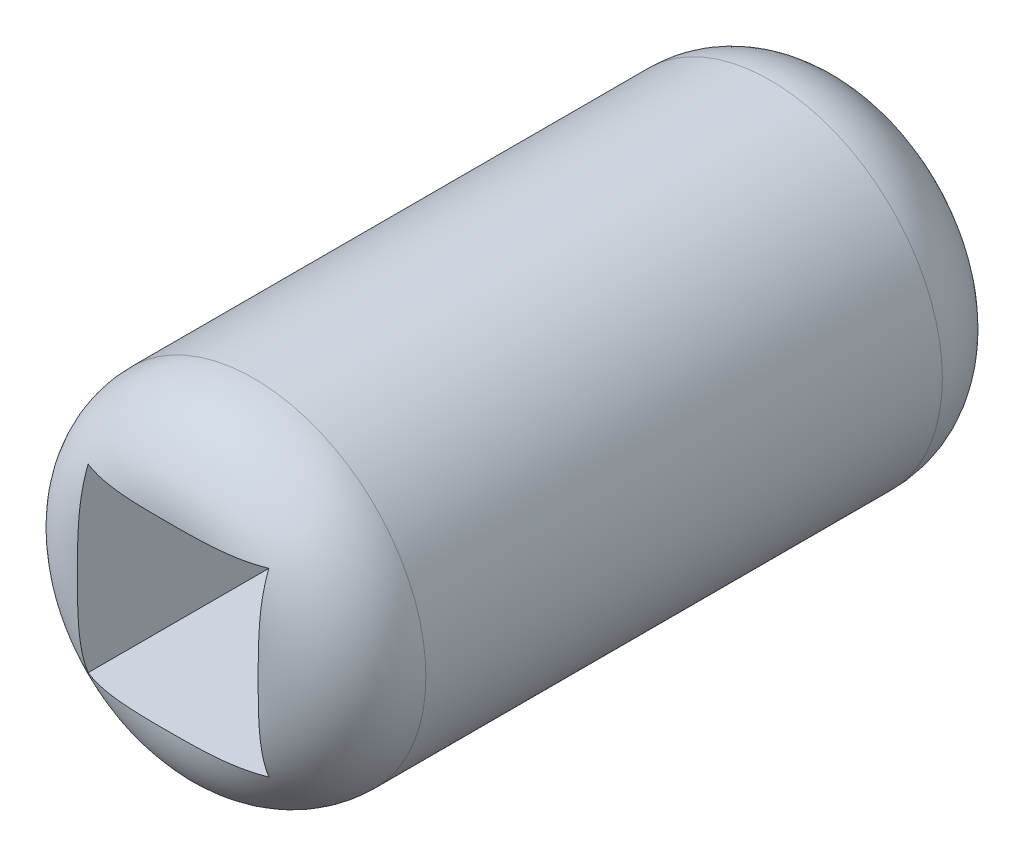
ISO-10303-21;
HEADER;
FILE_DESCRIPTION(('STEP AP214'),'2;1');
FILE_NAME('part.step','',(''),(''),'','','');
FILE_SCHEMA(('AUTOMOTIVE_DESIGN { 1 0 10303 214 1 1 1 1 }'));
ENDSEC;
DATA;
#1=APPLICATION_CONTEXT('core data for automotive mechanical design processes');
#2=APPLICATION_PROTOCOL_DEFINITION('international standard','automotive_design',2000,#1);
#3=PRODUCT_CONTEXT('',#1,'mechanical');
#4=PRODUCT('Part','Part','',(#3));
#5=PRODUCT_RELATED_PRODUCT_CATEGORY('part','',(#4));
#6=PRODUCT_DEFINITION_FORMATION('','',#4);
#7=PRODUCT_DEFINITION_CONTEXT('part definition',#1,'design');
#8=PRODUCT_DEFINITION('design','',#6,#7);
#9=PRODUCT_DEFINITION_SHAPE('','',#8);
#10=(LENGTH_UNIT() NAMED_UNIT(*) SI_UNIT(.MILLI.,.METRE.));
#11=(NAMED_UNIT(*) PLANE_ANGLE_UNIT() SI_UNIT($,.RADIAN.));
#12=(NAMED_UNIT(*) SI_UNIT($,.STERADIAN.) SOLID_ANGLE_UNIT());
#13=UNCERTAINTY_MEASURE_WITH_UNIT(LENGTH_MEASURE(1.E-05),#10,'distance_accuracy_value','');
#14=(GEOMETRIC_REPRESENTATION_CONTEXT(3) GLOBAL_UNCERTAINTY_ASSIGNED_CONTEXT((#13)) GLOBAL_UNIT_ASSIGNED_CONTEXT((#10,
#11,#12)) REPRESENTATION_CONTEXT('',''));
#15=CARTESIAN_POINT('',(0.,0.,0.));
#16=DIRECTION('',(0.,0.,1.));
#17=DIRECTION('',(1.,0.,0.));
#18=AXIS2_PLACEMENT_3D('',#15,#16,#17);
#19=CARTESIAN_POINT('',(0.,0.,0.));
#20=DIRECTION('',(0.,0.,-1.));
#21=DIRECTION('',(-1.,0.,0.));
#22=AXIS2_PLACEMENT_3D('',#19,#20,#21);
#23=CYLINDRICAL_SURFACE('',#22,2.55);
#24=CARTESIAN_POINT('',(0.,0.,-50.));
#25=DIRECTION('',(0.,0.,-1.));
#26=DIRECTION('',(-1.,0.,0.));
#27=AXIS2_PLACEMENT_3D('',#24,#25,#26);
#28=CIRCLE('',#27,2.55);
#29=CARTESIAN_POINT('',(-2.55,0.,-50.));
#30=VERTEX_POINT('',#29);
#31=EDGE_CURVE('E109',#30,#30,#28,.T.);
#32=ORIENTED_EDGE('',*,*,#31,.F.);
#33=EDGE_LOOP('',(#32));
#34=FACE_BOUND('',#33,.T.);
#35=CARTESIAN_POINT('',(0.,0.,-52.));
#36=DIRECTION('',(0.,0.,-1.));
#37=DIRECTION('',(-1.,0.,0.));
#38=AXIS2_PLACEMENT_3D('',#35,#36,#37);
#39=CIRCLE('',#38,2.55);
#40=CARTESIAN_POINT('',(-2.55,0.,-52.));
#41=VERTEX_POINT('',#40);
#42=EDGE_CURVE('E113',#41,#41,#39,.F.);
#43=ORIENTED_EDGE('',*,*,#42,.F.);
#44=EDGE_LOOP('',(#43));
#45=FACE_BOUND('',#44,.T.);
#46=ADVANCED_FACE('F38',(#34,#45),#23,.F.);
#47=CARTESIAN_POINT('',(0.,0.,-55.));
#48=DIRECTION('',(0.,0.,1.));
#49=DIRECTION('',(1.,0.,0.));
#50=AXIS2_PLACEMENT_3D('',#47,#48,#49);
#51=CYLINDRICAL_SURFACE('',#50,20.);
#52=CARTESIAN_POINT('',(0.,0.,15.));
#53=DIRECTION('',(0.,0.,1.));
#54=DIRECTION('',(1.,0.,0.));
#55=AXIS2_PLACEMENT_3D('',#52,#53,#54);
#56=CIRCLE('',#55,20.);
#57=CARTESIAN_POINT('',(20.,0.,15.));
#58=VERTEX_POINT('',#57);
#59=EDGE_CURVE('E47',#58,#58,#56,.F.);
#60=ORIENTED_EDGE('',*,*,#59,.T.);
#61=EDGE_LOOP('',(#60));
#62=FACE_BOUND('',#61,.T.);
#63=CARTESIAN_POINT('',(0.,0.,-45.));
#64=DIRECTION('',(0.,0.,1.));
#65=DIRECTION('',(1.,0.,0.));
#66=AXIS2_PLACEMENT_3D('',#63,#64,#65);
#67=CIRCLE('',#66,20.);
#68=CARTESIAN_POINT('',(20.,0.,-45.));
#69=VERTEX_POINT('',#68);
#70=EDGE_CURVE('E218',#69,#69,#67,.T.);
#71=ORIENTED_EDGE('',*,*,#70,.T.);
#72=EDGE_LOOP('',(#71));
#73=FACE_BOUND('',#72,.T.);
#74=ADVANCED_FACE('F156',(#62,#73),#51,.T.);
#75=CARTESIAN_POINT('',(0.,0.,-55.));
#76=DIRECTION('',(0.,0.,1.));
#77=DIRECTION('',(1.,0.,0.));
#78=AXIS2_PLACEMENT_3D('',#75,#76,#77);
#79=PLANE('',#78);
#80=CARTESIAN_POINT('',(0.,0.,-55.));
#81=DIRECTION('',(0.,0.,1.));
#82=DIRECTION('',(1.,0.,0.));
#83=AXIS2_PLACEMENT_3D('',#80,#81,#82);
#84=CIRCLE('',#83,10.);
#85=CARTESIAN_POINT('',(10.,0.,-55.));
#86=VERTEX_POINT('',#85);
#87=EDGE_CURVE('E11',#86,#86,#84,.F.);
#88=ORIENTED_EDGE('',*,*,#87,.T.);
#89=EDGE_LOOP('',(#88));
#90=FACE_BOUND('',#89,.T.);
#91=CARTESIAN_POINT('',(0.,0.,-55.));
#92=DIRECTION('',(0.,0.,-1.));
#93=DIRECTION('',(-1.,0.,0.));
#94=AXIS2_PLACEMENT_3D('',#91,#92,#93);
#95=CIRCLE('',#94,7.);
#96=CARTESIAN_POINT('',(-7.,0.,-55.));
#97=VERTEX_POINT('',#96);
#98=EDGE_CURVE('E116',#97,#97,#95,.T.);
#99=ORIENTED_EDGE('',*,*,#98,.F.);
#100=EDGE_LOOP('',(#99));
#101=FACE_BOUND('',#100,.T.);
#102=ADVANCED_FACE('F191',(#90,#101),#79,.F.);
#103=CARTESIAN_POINT('',(10.5,-10.5,50.));
#104=DIRECTION('',(-1.,0.,0.));
#105=DIRECTION('',(0.,0.,1.));
#106=AXIS2_PLACEMENT_3D('',#103,#104,#105);
#107=PLANE('',#106);
#108=CARTESIAN_POINT('',(10.5,-10.5,23.745561622809));
#109=CARTESIAN_POINT('',(10.5,-10.2820953312332,23.8310084995856));
#110=CARTESIAN_POINT('',(10.5,-10.0619659791213,23.9106518314645));
#111=CARTESIAN_POINT('',(10.5,-9.61814076353916,24.0589348982989));
#112=CARTESIAN_POINT('',(10.5,-9.39444664378138,24.1275798418574));
#113=CARTESIAN_POINT('',(10.5,-8.94491580691213,24.2543382269845));
#114=CARTESIAN_POINT('',(10.5,-8.71908870231958,24.3124859693475));
#115=CARTESIAN_POINT('',(10.5,-8.26518905010618,24.4192841094692));
#116=CARTESIAN_POINT('',(10.5,-8.03711623406637,24.4679333570821));
#117=CARTESIAN_POINT('',(10.5,-7.3541870184505,24.6000960661407));
#118=CARTESIAN_POINT('',(10.5,-6.89684302134824,24.6708563458332));
#119=CARTESIAN_POINT('',(10.5,-5.97856273663137,24.7851692434514));
#120=CARTESIAN_POINT('',(10.5,-5.51762359824146,24.8286974339367));
#121=CARTESIAN_POINT('',(10.5,-4.63711294746988,24.8927615944288));
#122=CARTESIAN_POINT('',(10.5,-4.21766083545257,24.9150525852469));
#123=CARTESIAN_POINT('',(10.5,-3.37846111646088,24.9485716373263));
#124=CARTESIAN_POINT('',(10.5,-2.95871360957952,24.959802463004));
#125=CARTESIAN_POINT('',(10.5,-2.32735362697719,24.9717400651592));
#126=CARTESIAN_POINT('',(10.5,-2.11577827115353,24.9749037850208));
#127=CARTESIAN_POINT('',(10.5,-1.69261161496323,24.9799852820541));
#128=CARTESIAN_POINT('',(10.5,-1.48102031456945,24.9819030570554));
#129=CARTESIAN_POINT('',(10.5,-1.05785688988513,24.9848388513147));
#130=CARTESIAN_POINT('',(10.5,-0.846284766230479,24.9858569753128));
#131=CARTESIAN_POINT('',(10.5,-0.423141632686202,24.9871714675552));
#132=CARTESIAN_POINT('',(10.5,-0.211570622834858,24.9874678475918));
#133=CARTESIAN_POINT('',(10.5,0.,24.9874921777191));
#134=B_SPLINE_CURVE_WITH_KNOTS('',3,(#108,#109,#110,#111,#112,#113,#114,#115,#116,#117,#118,
#119,#120,#121,#122,#123,#124,#125,#126,#127,#128,#129,#130,#131,#132,#133),.UNSPECIFIED.,.F.,
.F.,(4,2,2,2,2,2,2,2,2,2,2,2,4),(0.,0.702025204485356,1.40371695574493,2.10307262443637,
2.80251292368591,4.18968103787796,5.57809167754459,6.83801126825105,8.09761587026198,
8.73241127418308,9.36720778390113,10.0019303789456,10.6366426033795),.UNSPECIFIED.);
#135=CARTESIAN_POINT('',(10.5,-10.5,23.745561622809));
#136=VERTEX_POINT('',#135);
#137=CARTESIAN_POINT('',(10.5,0.,24.9874921777191));
#138=VERTEX_POINT('',#137);
#139=EDGE_CURVE('E93',#136,#138,#134,.T.);
#140=ORIENTED_EDGE('',*,*,#139,.T.);
#141=CARTESIAN_POINT('',(10.5,0.,24.9874921777191));
#142=CARTESIAN_POINT('',(10.5,0.221423204439968,24.9874630424113));
#143=CARTESIAN_POINT('',(10.5,0.442846906870143,24.987140852023));
#144=CARTESIAN_POINT('',(10.5,0.885696222999842,24.985697516879));
#145=CARTESIAN_POINT('',(10.5,1.10712183664208,24.9845763553695));
#146=CARTESIAN_POINT('',(10.5,1.55003468137708,24.9813217168943));
#147=CARTESIAN_POINT('',(10.5,1.77152191048333,24.9791879287923));
#148=CARTESIAN_POINT('',(10.5,2.21447669861017,24.9734943961953));
#149=CARTESIAN_POINT('',(10.5,2.43594425768813,24.9699346560062));
#150=CARTESIAN_POINT('',(10.5,3.09650405305266,24.9564309073825));
#151=CARTESIAN_POINT('',(10.5,3.5355497766985,24.9436508162303));
#152=CARTESIAN_POINT('',(10.5,4.41320079831898,24.905223892119));
#153=CARTESIAN_POINT('',(10.5,4.85180602272994,24.8795751830866));
#154=CARTESIAN_POINT('',(10.5,5.7316836655817,24.8089126507154));
#155=CARTESIAN_POINT('',(10.5,6.17294241813557,24.7637191213698));
#156=CARTESIAN_POINT('',(10.5,7.05187001518709,24.6474670360696));
#157=CARTESIAN_POINT('',(10.5,7.48954143888598,24.5764291082983));
#158=CARTESIAN_POINT('',(10.5,8.14303306654956,24.4455779948419));
#159=CARTESIAN_POINT('',(10.5,8.36125652381611,24.3976628579725));
#160=CARTESIAN_POINT('',(10.5,8.79557255981704,24.2930226424308));
#161=CARTESIAN_POINT('',(10.5,9.01166536354846,24.2362985048187));
#162=CARTESIAN_POINT('',(10.5,9.44179970212028,24.1132033021743));
#163=CARTESIAN_POINT('',(10.5,9.65583317239433,24.0468039016714));
#164=CARTESIAN_POINT('',(10.5,10.0805930708052,23.9038997232101));
#165=CARTESIAN_POINT('',(10.5,10.2913180766552,23.827390725465));
#166=CARTESIAN_POINT('',(10.5,10.5,23.7455616228092));
#167=B_SPLINE_CURVE_WITH_KNOTS('',3,(#141,#142,#143,#144,#145,#146,#147,#148,#149,#150,#151,
#152,#153,#154,#155,#156,#157,#158,#159,#160,#161,#162,#163,#164,#165,#166),.UNSPECIFIED.,.F.,
.F.,(4,2,2,2,2,2,2,2,2,2,2,2,4),(0.,0.664270109941244,1.32855414944726,1.99304242686941,
2.65752869771302,3.97511313219947,5.29288970881806,6.62304921567723,7.95214935211501,
8.62226143678734,9.29230198296447,9.96434582633915,10.6366710749151),.UNSPECIFIED.);
#168=CARTESIAN_POINT('',(10.5,10.5,23.745561622809));
#169=VERTEX_POINT('',#168);
#170=EDGE_CURVE('E91',#138,#169,#167,.T.);
#171=ORIENTED_EDGE('',*,*,#170,.T.);
#172=DIRECTION('',(0.,0.,-1.));
#173=VECTOR('',#172,1.);
#174=CARTESIAN_POINT('',(10.5,10.5,50.));
#175=LINE('',#174,#173);
#176=CARTESIAN_POINT('',(10.5,10.5,-50.));
#177=VERTEX_POINT('',#176);
#178=EDGE_CURVE('E83',#169,#177,#175,.T.);
#179=ORIENTED_EDGE('',*,*,#178,.T.);
#180=DIRECTION('',(0.,1.,0.));
#181=VECTOR('',#180,1.);
#182=CARTESIAN_POINT('',(10.5,-10.5,-50.));
#183=LINE('',#182,#181);
#184=CARTESIAN_POINT('',(10.5,-10.5,-50.));
#185=VERTEX_POINT('',#184);
#186=EDGE_CURVE('E88',#185,#177,#183,.T.);
#187=ORIENTED_EDGE('',*,*,#186,.F.);
#188=DIRECTION('',(0.,0.,-1.));
#189=VECTOR('',#188,1.);
#190=CARTESIAN_POINT('',(10.5,-10.5,50.));
#191=LINE('',#190,#189);
#192=EDGE_CURVE('E123',#136,#185,#191,.T.);
#193=ORIENTED_EDGE('',*,*,#192,.F.);
#194=EDGE_LOOP('',(#140,#171,#179,#187,#193));
#195=FACE_BOUND('',#194,.T.);
#196=ADVANCED_FACE('F85',(#195),#107,.T.);
#197=CARTESIAN_POINT('',(-10.5,10.5,50.));
#198=DIRECTION('',(0.,-1.,0.));
#199=DIRECTION('',(0.,0.,-1.));
#200=AXIS2_PLACEMENT_3D('',#197,#198,#199);
#201=PLANE('',#200);
#202=ORIENTED_EDGE('',*,*,#178,.F.);
#203=CARTESIAN_POINT('',(10.5,10.5,23.745561622809));
#204=CARTESIAN_POINT('',(10.2835748942635,10.5,23.8304280457561));
#205=CARTESIAN_POINT('',(10.0649550581823,10.5,23.9095698882964));
#206=CARTESIAN_POINT('',(9.62419066302592,10.5,24.0569950410334));
#207=CARTESIAN_POINT('',(9.40204779648804,10.5,24.1252834014723));
#208=CARTESIAN_POINT('',(8.9556982112672,10.5,24.2514442653665));
#209=CARTESIAN_POINT('',(8.73150171455172,10.5,24.3093531451678));
#210=CARTESIAN_POINT('',(8.28088521552548,10.5,24.4157903737855));
#211=CARTESIAN_POINT('',(8.054464951704,10.5,24.464317605116));
#212=CARTESIAN_POINT('',(7.37010774049275,10.5,24.5975029892255));
#213=CARTESIAN_POINT('',(6.90958809617885,10.5,24.6690746225939));
#214=CARTESIAN_POINT('',(6.2162360233444,10.5,24.7556771331127));
#215=CARTESIAN_POINT('',(5.98457713201519,10.5,24.7810927499888));
#216=CARTESIAN_POINT('',(5.52067506017507,10.5,24.8259388818956));
#217=CARTESIAN_POINT('',(5.28843188859176,10.5,24.8453694878221));
#218=CARTESIAN_POINT('',(4.56098138803612,10.5,24.8983081574619));
#219=CARTESIAN_POINT('',(4.0651352511916,10.5,24.9229174348038));
#220=CARTESIAN_POINT('',(3.32102194212009,10.5,24.949166879232));
#221=CARTESIAN_POINT('',(3.07289312823323,10.5,24.9561395043126));
#222=CARTESIAN_POINT('',(2.57657406784095,10.5,24.9674454744056));
#223=CARTESIAN_POINT('',(2.32838382219619,10.5,24.9717788545078));
#224=CARTESIAN_POINT('',(1.83169306214223,10.5,24.9785917604535));
#225=CARTESIAN_POINT('',(1.58319252245418,10.5,24.9810691253163));
#226=CARTESIAN_POINT('',(1.08618182262432,10.5,24.9847390053464));
#227=CARTESIAN_POINT('',(0.837671662468739,10.5,24.9859315186025));
#228=CARTESIAN_POINT('',(0.340683255518348,10.5,24.9873716811018));
#229=CARTESIAN_POINT('',(0.0922050090451002,10.5,24.9876194605327));
#230=CARTESIAN_POINT('',(-0.404750693599833,10.5,24.9872483285497));
#231=CARTESIAN_POINT('',(-0.653228149772027,10.5,24.9866294179133));
#232=CARTESIAN_POINT('',(-1.14927839481827,10.5,24.9843396618238));
#233=CARTESIAN_POINT('',(-1.39685119942949,10.5,24.9826726360382));
#234=CARTESIAN_POINT('',(-1.89198382090432,10.5,24.9778516308698));
#235=CARTESIAN_POINT('',(-2.13954363772699,10.5,24.9746976470511));
#236=CARTESIAN_POINT('',(-2.63468507915313,10.5,24.9662435167823));
#237=CARTESIAN_POINT('',(-2.88226669639269,10.5,24.9609428939295));
#238=CARTESIAN_POINT('',(-3.37734663742692,10.5,24.9473506668242));
#239=CARTESIAN_POINT('',(-3.62484496124234,10.5,24.9390590633171));
#240=CARTESIAN_POINT('',(-4.36607147427464,10.5,24.9082969279563));
#241=CARTESIAN_POINT('',(-4.85958957810443,10.5,24.8799289500097));
#242=CARTESIAN_POINT('',(-5.84453512995613,10.5,24.798740799315));
#243=CARTESIAN_POINT('',(-6.33596356029214,10.5,24.7459337961361));
#244=CARTESIAN_POINT('',(-7.1383601137208,10.5,24.6319064595174));
#245=CARTESIAN_POINT('',(-7.45071465317807,10.5,24.5805292642351));
#246=CARTESIAN_POINT('',(-8.07245797179513,10.5,24.4618569685851));
#247=CARTESIAN_POINT('',(-8.38184645590487,10.5,24.3945603013693));
#248=CARTESIAN_POINT('',(-8.99635643437308,10.5,24.2419774181668));
#249=CARTESIAN_POINT('',(-9.3014760678764,10.5,24.1566836024253));
#250=CARTESIAN_POINT('',(-9.90574207915073,10.5,23.9663559343863));
#251=CARTESIAN_POINT('',(-10.2048834189848,10.5,23.8613061504062));
#252=CARTESIAN_POINT('',(-10.5,10.5,23.745561622809));
#253=B_SPLINE_CURVE_WITH_KNOTS('',3,(#203,#204,#205,#206,#207,#208,#209,#210,#211,#212,#213,
#214,#215,#216,#217,#218,#219,#220,#221,#222,#223,#224,#225,#226,#227,#228,#229,#230,#231,#232,
#233,#234,#235,#236,#237,#238,#239,#240,#241,#242,#243,#244,#245,#246,#247,#248,#249,#250,#251,
#252),.UNSPECIFIED.,.F.,.F.,(4,2,2,2,2,2,2,2,2,2,2,2,2,2,2,2,2,2,2,2,2,2,2,2,4),(0.,
0.697260024351112,1.39419465019898,2.08863686248113,2.78316174167626,4.18001009890612,
4.87911145196581,5.57820218708144,7.06715702423859,7.81183657102314,8.55650621678973,
9.30204154863823,10.0475779895514,10.7930116892392,11.5384447201625,12.2811767765433,
13.0239110486867,13.7668102459362,14.5097092580165,15.9923331411893,17.474159004674,
18.4234679994783,19.3728704673875,20.3226746499162,21.2732480873042),.UNSPECIFIED.);
#254=CARTESIAN_POINT('',(-10.5,10.5,23.745561622809));
#255=VERTEX_POINT('',#254);
#256=EDGE_CURVE('E62',#169,#255,#253,.T.);
#257=ORIENTED_EDGE('',*,*,#256,.T.);
#258=DIRECTION('',(0.,0.,-1.));
#259=VECTOR('',#258,1.);
#260=CARTESIAN_POINT('',(-10.5,10.5,50.));
#261=LINE('',#260,#259);
#262=CARTESIAN_POINT('',(-10.5,10.5,-50.));
#263=VERTEX_POINT('',#262);
#264=EDGE_CURVE('E94',#255,#263,#261,.T.);
#265=ORIENTED_EDGE('',*,*,#264,.T.);
#266=DIRECTION('',(-1.,0.,0.));
#267=VECTOR('',#266,1.);
#268=CARTESIAN_POINT('',(-10.5,10.5,-50.));
#269=LINE('',#268,#267);
#270=EDGE_CURVE('E97',#177,#263,#269,.T.);
#271=ORIENTED_EDGE('',*,*,#270,.F.);
#272=EDGE_LOOP('',(#202,#257,#265,#271));
#273=FACE_BOUND('',#272,.T.);
#274=ADVANCED_FACE('F98',(#273),#201,.T.);
#275=CARTESIAN_POINT('',(-10.5,-10.5,50.));
#276=DIRECTION('',(1.,0.,0.));
#277=DIRECTION('',(0.,0.,-1.));
#278=AXIS2_PLACEMENT_3D('',#275,#276,#277);
#279=PLANE('',#278);
#280=ORIENTED_EDGE('',*,*,#264,.F.);
#281=CARTESIAN_POINT('',(-10.5,10.5,23.745561622809));
#282=CARTESIAN_POINT('',(-10.5,10.2835748942634,23.8304280457561));
#283=CARTESIAN_POINT('',(-10.5,10.0649550581823,23.9095698882964));
#284=CARTESIAN_POINT('',(-10.5,9.62419066302591,24.0569950410334));
#285=CARTESIAN_POINT('',(-10.5,9.40204779648803,24.1252834014723));
#286=CARTESIAN_POINT('',(-10.5,8.95569821126719,24.2514442653665));
#287=CARTESIAN_POINT('',(-10.5,8.73150171455172,24.3093531451678));
#288=CARTESIAN_POINT('',(-10.5,8.28088521552547,24.4157903737856));
#289=CARTESIAN_POINT('',(-10.5,8.05446495170399,24.464317605116));
#290=CARTESIAN_POINT('',(-10.5,7.37010774049274,24.5975029892255));
#291=CARTESIAN_POINT('',(-10.5,6.90958809617884,24.6690746225939));
#292=CARTESIAN_POINT('',(-10.5,6.2162360233444,24.7556771331127));
#293=CARTESIAN_POINT('',(-10.5,5.98457713201519,24.7810927499888));
#294=CARTESIAN_POINT('',(-10.5,5.52067506017506,24.8259388818956));
#295=CARTESIAN_POINT('',(-10.5,5.28843188859176,24.8453694878221));
#296=CARTESIAN_POINT('',(-10.5,4.56098138803611,24.8983081574619));
#297=CARTESIAN_POINT('',(-10.5,4.06513525119159,24.9229174348038));
#298=CARTESIAN_POINT('',(-10.5,3.32102194212008,24.949166879232));
#299=CARTESIAN_POINT('',(-10.5,3.07289312823322,24.9561395043126));
#300=CARTESIAN_POINT('',(-10.5,2.57657406784094,24.9674454744056));
#301=CARTESIAN_POINT('',(-10.5,2.32838382219617,24.9717788545078));
#302=CARTESIAN_POINT('',(-10.5,1.83169306214222,24.9785917604535));
#303=CARTESIAN_POINT('',(-10.5,1.58319252245417,24.9810691253163));
#304=CARTESIAN_POINT('',(-10.5,1.0861818226243,24.9847390053464));
#305=CARTESIAN_POINT('',(-10.5,0.837671662468727,24.9859315186025));
#306=CARTESIAN_POINT('',(-10.5,0.340683255518335,24.9873716811018));
#307=CARTESIAN_POINT('',(-10.5,0.0922050090450874,24.9876194605327));
#308=CARTESIAN_POINT('',(-10.5,-0.404750693599846,24.9872483285497));
#309=CARTESIAN_POINT('',(-10.5,-0.653228149772042,24.9866294179133));
#310=CARTESIAN_POINT('',(-10.5,-1.14927839481828,24.9843396618238));
#311=CARTESIAN_POINT('',(-10.5,-1.39685119942951,24.9826726360382));
#312=CARTESIAN_POINT('',(-10.5,-1.89198382090434,24.9778516308698));
#313=CARTESIAN_POINT('',(-10.5,-2.13954363772701,24.9746976470511));
#314=CARTESIAN_POINT('',(-10.5,-2.63468507915315,24.9662435167823));
#315=CARTESIAN_POINT('',(-10.5,-2.88226669639271,24.9609428939295));
#316=CARTESIAN_POINT('',(-10.5,-3.37734663742694,24.9473506668242));
#317=CARTESIAN_POINT('',(-10.5,-3.62484496124236,24.9390590633171));
#318=CARTESIAN_POINT('',(-10.5,-4.36607147427466,24.9082969279563));
#319=CARTESIAN_POINT('',(-10.5,-4.85958957810445,24.8799289500097));
#320=CARTESIAN_POINT('',(-10.5,-5.84453512995615,24.798740799315));
#321=CARTESIAN_POINT('',(-10.5,-6.33596356029216,24.7459337961361));
#322=CARTESIAN_POINT('',(-10.5,-7.13836011372081,24.6319064595174));
#323=CARTESIAN_POINT('',(-10.5,-7.45071465317809,24.5805292642351));
#324=CARTESIAN_POINT('',(-10.5,-8.07245797179515,24.4618569685851));
#325=CARTESIAN_POINT('',(-10.5,-8.38184645590489,24.3945603013693));
#326=CARTESIAN_POINT('',(-10.5,-8.99635643437309,24.2419774181668));
#327=CARTESIAN_POINT('',(-10.5,-9.30147606787641,24.1566836024253));
#328=CARTESIAN_POINT('',(-10.5,-9.90574207915074,23.9663559343863));
#329=CARTESIAN_POINT('',(-10.5,-10.2048834189848,23.8613061504062));
#330=CARTESIAN_POINT('',(-10.5,-10.5,23.745561622809));
#331=B_SPLINE_CURVE_WITH_KNOTS('',3,(#281,#282,#283,#284,#285,#286,#287,#288,#289,#290,#291,
#292,#293,#294,#295,#296,#297,#298,#299,#300,#301,#302,#303,#304,#305,#306,#307,#308,#309,#310,
#311,#312,#313,#314,#315,#316,#317,#318,#319,#320,#321,#322,#323,#324,#325,#326,#327,#328,#329,
#330),.UNSPECIFIED.,.F.,.F.,(4,2,2,2,2,2,2,2,2,2,2,2,2,2,2,2,2,2,2,2,2,2,2,2,4),(0.,
0.697260024351112,1.39419465019898,2.08863686248113,2.78316174167626,4.18001009890612,
4.8791114519658,5.57820218708144,7.06715702423859,7.81183657102314,8.55650621678973,
9.30204154863823,10.0475779895514,10.7930116892392,11.5384447201625,12.2811767765433,
13.0239110486867,13.7668102459363,14.5097092580166,15.9923331411893,17.474159004674,
18.4234679994783,19.3728704673875,20.3226746499162,21.2732480873042),.UNSPECIFIED.);
#332=CARTESIAN_POINT('',(-10.5,-10.5,23.745561622809));
#333=VERTEX_POINT('',#332);
#334=EDGE_CURVE('E54',#255,#333,#331,.T.);
#335=ORIENTED_EDGE('',*,*,#334,.T.);
#336=DIRECTION('',(0.,0.,-1.));
#337=VECTOR('',#336,1.);
#338=CARTESIAN_POINT('',(-10.5,-10.5,50.));
#339=LINE('',#338,#337);
#340=CARTESIAN_POINT('',(-10.5,-10.5,-50.));
#341=VERTEX_POINT('',#340);
#342=EDGE_CURVE('E126',#333,#341,#339,.T.);
#343=ORIENTED_EDGE('',*,*,#342,.T.);
#344=DIRECTION('',(0.,-1.,0.));
#345=VECTOR('',#344,1.);
#346=CARTESIAN_POINT('',(-10.5,-10.5,-50.));
#347=LINE('',#346,#345);
#348=EDGE_CURVE('E103',#263,#341,#347,.T.);
#349=ORIENTED_EDGE('',*,*,#348,.F.);
#350=EDGE_LOOP('',(#280,#335,#343,#349));
#351=FACE_BOUND('',#350,.T.);
#352=ADVANCED_FACE('F180',(#351),#279,.T.);
#353=CARTESIAN_POINT('',(-10.5,-10.5,50.));
#354=DIRECTION('',(0.,1.,0.));
#355=DIRECTION('',(0.,0.,1.));
#356=AXIS2_PLACEMENT_3D('',#353,#354,#355);
#357=PLANE('',#356);
#358=ORIENTED_EDGE('',*,*,#342,.F.);
#359=CARTESIAN_POINT('',(-10.5,-10.5,23.745561622809));
#360=CARTESIAN_POINT('',(-10.2835748942634,-10.5,23.8304280457561));
#361=CARTESIAN_POINT('',(-10.0649550581823,-10.5,23.9095698882964));
#362=CARTESIAN_POINT('',(-9.6241906630259,-10.5,24.0569950410334));
#363=CARTESIAN_POINT('',(-9.40204779648802,-10.5,24.1252834014723));
#364=CARTESIAN_POINT('',(-8.95569821126718,-10.5,24.2514442653665));
#365=CARTESIAN_POINT('',(-8.7315017145517,-10.5,24.3093531451678));
#366=CARTESIAN_POINT('',(-8.28088521552546,-10.5,24.4157903737856));
#367=CARTESIAN_POINT('',(-8.05446495170398,-10.5,24.464317605116));
#368=CARTESIAN_POINT('',(-7.37010774049273,-10.5,24.5975029892255));
#369=CARTESIAN_POINT('',(-6.90958809617883,-10.5,24.6690746225939));
#370=CARTESIAN_POINT('',(-6.21623602334438,-10.5,24.7556771331127));
#371=CARTESIAN_POINT('',(-5.98457713201517,-10.5,24.7810927499888));
#372=CARTESIAN_POINT('',(-5.52067506017504,-10.5,24.8259388818956));
#373=CARTESIAN_POINT('',(-5.28843188859174,-10.5,24.8453694878221));
#374=CARTESIAN_POINT('',(-4.56098138803609,-10.5,24.8983081574619));
#375=CARTESIAN_POINT('',(-4.06513525119157,-10.5,24.9229174348038));
#376=CARTESIAN_POINT('',(-3.32102194212007,-10.5,24.949166879232));
#377=CARTESIAN_POINT('',(-3.07289312823321,-10.5,24.9561395043126));
#378=CARTESIAN_POINT('',(-2.57657406784093,-10.5,24.9674454744056));
#379=CARTESIAN_POINT('',(-2.32838382219616,-10.5,24.9717788545078));
#380=CARTESIAN_POINT('',(-1.8316930621422,-10.5,24.9785917604535));
#381=CARTESIAN_POINT('',(-1.58319252245415,-10.5,24.9810691253163));
#382=CARTESIAN_POINT('',(-1.08618182262429,-10.5,24.9847390053464));
#383=CARTESIAN_POINT('',(-0.837671662468715,-10.5,24.9859315186025));
#384=CARTESIAN_POINT('',(-0.340683255518324,-10.5,24.9873716811018));
#385=CARTESIAN_POINT('',(-0.0922050090450765,-10.5,24.9876194605327));
#386=CARTESIAN_POINT('',(0.404750693599856,-10.5,24.9872483285497));
#387=CARTESIAN_POINT('',(0.65322814977205,-10.5,24.9866294179133));
#388=CARTESIAN_POINT('',(1.14927839481829,-10.5,24.9843396618238));
#389=CARTESIAN_POINT('',(1.39685119942951,-10.5,24.9826726360382));
#390=CARTESIAN_POINT('',(1.89198382090435,-10.5,24.9778516308698));
#391=CARTESIAN_POINT('',(2.13954363772701,-10.5,24.9746976470511));
#392=CARTESIAN_POINT('',(2.63468507915316,-10.5,24.9662435167823));
#393=CARTESIAN_POINT('',(2.88226669639271,-10.5,24.9609428939295));
#394=CARTESIAN_POINT('',(3.37734663742694,-10.5,24.9473506668242));
#395=CARTESIAN_POINT('',(3.62484496124236,-10.5,24.9390590633171));
#396=CARTESIAN_POINT('',(4.36607147427466,-10.5,24.9082969279563));
#397=CARTESIAN_POINT('',(4.85958957810445,-10.5,24.8799289500097));
#398=CARTESIAN_POINT('',(5.84453512995615,-10.5,24.798740799315));
#399=CARTESIAN_POINT('',(6.33596356029215,-10.5,24.7459337961361));
#400=CARTESIAN_POINT('',(7.13836011372081,-10.5,24.6319064595174));
#401=CARTESIAN_POINT('',(7.45071465317809,-10.5,24.5805292642351));
#402=CARTESIAN_POINT('',(8.07245797179515,-10.5,24.4618569685851));
#403=CARTESIAN_POINT('',(8.38184645590489,-10.5,24.3945603013693));
#404=CARTESIAN_POINT('',(8.99635643437309,-10.5,24.2419774181668));
#405=CARTESIAN_POINT('',(9.30147606787642,-10.5,24.1566836024253));
#406=CARTESIAN_POINT('',(9.90574207915074,-10.5,23.9663559343863));
#407=CARTESIAN_POINT('',(10.2048834189848,-10.5,23.8613061504062));
#408=CARTESIAN_POINT('',(10.5,-10.5,23.745561622809));
#409=B_SPLINE_CURVE_WITH_KNOTS('',3,(#359,#360,#361,#362,#363,#364,#365,#366,#367,#368,#369,
#370,#371,#372,#373,#374,#375,#376,#377,#378,#379,#380,#381,#382,#383,#384,#385,#386,#387,#388,
#389,#390,#391,#392,#393,#394,#395,#396,#397,#398,#399,#400,#401,#402,#403,#404,#405,#406,#407,
#408),.UNSPECIFIED.,.F.,.F.,(4,2,2,2,2,2,2,2,2,2,2,2,2,2,2,2,2,2,2,2,2,2,2,2,4),(0.,
0.697260024351113,1.39419465019898,2.08863686248113,2.78316174167626,4.18001009890612,
4.87911145196581,5.57820218708145,7.0671570242386,7.81183657102314,8.55650621678973,
9.30204154863824,10.0475779895514,10.7930116892392,11.5384447201625,12.2811767765433,
13.0239110486867,13.7668102459362,14.5097092580165,15.9923331411893,17.474159004674,
18.4234679994783,19.3728704673875,20.3226746499162,21.2732480873042),.UNSPECIFIED.);
#410=EDGE_CURVE('E173',#333,#136,#409,.T.);
#411=ORIENTED_EDGE('',*,*,#410,.T.);
#412=ORIENTED_EDGE('',*,*,#192,.T.);
#413=DIRECTION('',(1.,0.,0.));
#414=VECTOR('',#413,1.);
#415=CARTESIAN_POINT('',(-10.5,-10.5,-50.));
#416=LINE('',#415,#414);
#417=EDGE_CURVE('E107',#341,#185,#416,.T.);
#418=ORIENTED_EDGE('',*,*,#417,.F.);
#419=EDGE_LOOP('',(#358,#411,#412,#418));
#420=FACE_BOUND('',#419,.T.);
#421=ADVANCED_FACE('F183',(#420),#357,.T.);
#422=CARTESIAN_POINT('',(0.,0.,-50.));
#423=DIRECTION('',(0.,0.,-1.));
#424=DIRECTION('',(-1.,0.,0.));
#425=AXIS2_PLACEMENT_3D('',#422,#423,#424);
#426=PLANE('',#425);
#427=ORIENTED_EDGE('',*,*,#31,.T.);
#428=EDGE_LOOP('',(#427));
#429=FACE_BOUND('',#428,.T.);
#430=ORIENTED_EDGE('',*,*,#186,.T.);
#431=ORIENTED_EDGE('',*,*,#270,.T.);
#432=ORIENTED_EDGE('',*,*,#348,.T.);
#433=ORIENTED_EDGE('',*,*,#417,.T.);
#434=EDGE_LOOP('',(#430,#431,#432,#433));
#435=FACE_BOUND('',#434,.T.);
#436=ADVANCED_FACE('F105',(#429,#435),#426,.F.);
#437=CARTESIAN_POINT('',(0.,0.,-52.));
#438=DIRECTION('',(0.,0.,-1.));
#439=DIRECTION('',(-1.,0.,0.));
#440=AXIS2_PLACEMENT_3D('',#437,#438,#439);
#441=PLANE('',#440);
#442=CARTESIAN_POINT('',(0.,0.,-52.));
#443=DIRECTION('',(0.,0.,-1.));
#444=DIRECTION('',(-1.,0.,0.));
#445=AXIS2_PLACEMENT_3D('',#442,#443,#444);
#446=CIRCLE('',#445,7.);
#447=CARTESIAN_POINT('',(-7.,0.,-52.));
#448=VERTEX_POINT('',#447);
#449=EDGE_CURVE('E134',#448,#448,#446,.T.);
#450=ORIENTED_EDGE('',*,*,#449,.T.);
#451=EDGE_LOOP('',(#450));
#452=FACE_BOUND('',#451,.T.);
#453=ORIENTED_EDGE('',*,*,#42,.T.);
#454=EDGE_LOOP('',(#453));
#455=FACE_BOUND('',#454,.T.);
#456=ADVANCED_FACE('F204',(#452,#455),#441,.T.);
#457=CARTESIAN_POINT('',(0.,0.,-52.));
#458=DIRECTION('',(0.,0.,-1.));
#459=DIRECTION('',(-1.,0.,0.));
#460=AXIS2_PLACEMENT_3D('',#457,#458,#459);
#461=CYLINDRICAL_SURFACE('',#460,7.);
#462=ORIENTED_EDGE('',*,*,#449,.F.);
#463=EDGE_LOOP('',(#462));
#464=FACE_BOUND('',#463,.T.);
#465=ORIENTED_EDGE('',*,*,#98,.T.);
#466=EDGE_LOOP('',(#465));
#467=FACE_BOUND('',#466,.T.);
#468=ADVANCED_FACE('F154',(#464,#467),#461,.F.);
#469=CARTESIAN_POINT('',(0.,0.,15.));
#470=DIRECTION('',(0.,0.,1.));
#471=DIRECTION('',(1.,0.,0.));
#472=AXIS2_PLACEMENT_3D('',#469,#470,#471);
#473=DEGENERATE_TOROIDAL_SURFACE('',#472,10.,10.,.T.);
#474=ORIENTED_EDGE('',*,*,#59,.F.);
#475=EDGE_LOOP('',(#474));
#476=FACE_BOUND('',#475,.T.);
#477=ORIENTED_EDGE('',*,*,#256,.F.);
#478=ORIENTED_EDGE('',*,*,#170,.F.);
#479=ORIENTED_EDGE('',*,*,#139,.F.);
#480=ORIENTED_EDGE('',*,*,#410,.F.);
#481=ORIENTED_EDGE('',*,*,#334,.F.);
#482=EDGE_LOOP('',(#477,#478,#479,#480,#481));
#483=FACE_BOUND('',#482,.T.);
#484=ADVANCED_FACE('F150',(#476,#483),#473,.T.);
#485=CARTESIAN_POINT('',(0.,0.,-45.));
#486=DIRECTION('',(0.,0.,1.));
#487=DIRECTION('',(1.,0.,0.));
#488=AXIS2_PLACEMENT_3D('',#485,#486,#487);
#489=DEGENERATE_TOROIDAL_SURFACE('',#488,10.,10.,.T.);
#490=ORIENTED_EDGE('',*,*,#87,.F.);
#491=EDGE_LOOP('',(#490));
#492=FACE_BOUND('',#491,.T.);
#493=ORIENTED_EDGE('',*,*,#70,.F.);
#494=EDGE_LOOP('',(#493));
#495=FACE_BOUND('',#494,.T.);
#496=ADVANCED_FACE('F40',(#492,#495),#489,.T.);
#497=CLOSED_SHELL('',(#46,#74,#102,#196,#274,#352,#421,#436,#456,#468,#484,#496));
#498=MANIFOLD_SOLID_BREP('B2',#497);
#499=ADVANCED_BREP_SHAPE_REPRESENTATION('',(#18,#498),#14);
#500=SHAPE_DEFINITION_REPRESENTATION(#9,#499);
ENDSEC;
END-ISO-10303-21;
